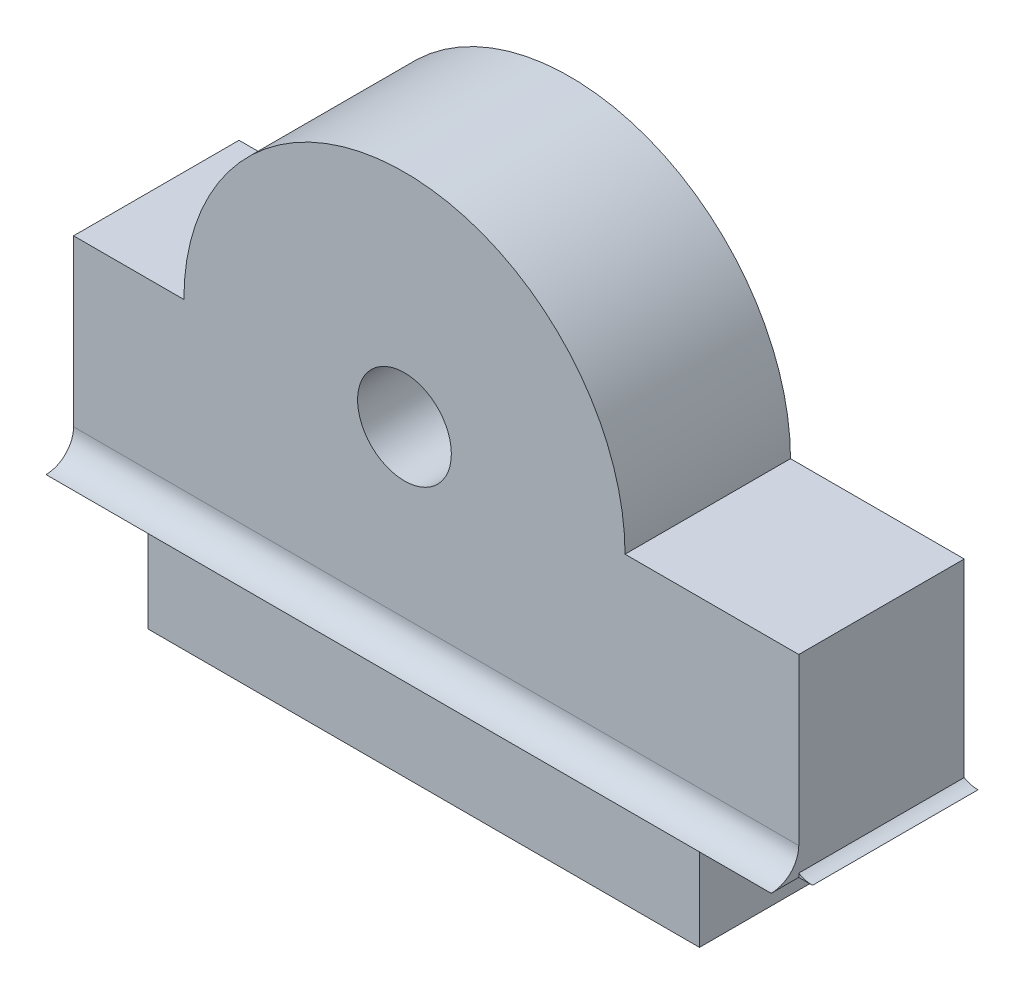
ISO-10303-21;
HEADER;
FILE_DESCRIPTION(('STEP AP214'),'2;1');
FILE_NAME('part.step','',(''),(''),'','','');
FILE_SCHEMA(('AUTOMOTIVE_DESIGN { 1 0 10303 214 1 1 1 1 }'));
ENDSEC;
DATA;
#1=APPLICATION_CONTEXT('core data for automotive mechanical design processes');
#2=APPLICATION_PROTOCOL_DEFINITION('international standard','automotive_design',2000,#1);
#3=PRODUCT_CONTEXT('',#1,'mechanical');
#4=PRODUCT('Part','Part','',(#3));
#5=PRODUCT_RELATED_PRODUCT_CATEGORY('part','',(#4));
#6=PRODUCT_DEFINITION_FORMATION('','',#4);
#7=PRODUCT_DEFINITION_CONTEXT('part definition',#1,'design');
#8=PRODUCT_DEFINITION('design','',#6,#7);
#9=PRODUCT_DEFINITION_SHAPE('','',#8);
#10=(LENGTH_UNIT() NAMED_UNIT(*) SI_UNIT(.MILLI.,.METRE.));
#11=(NAMED_UNIT(*) PLANE_ANGLE_UNIT() SI_UNIT($,.RADIAN.));
#12=(NAMED_UNIT(*) SI_UNIT($,.STERADIAN.) SOLID_ANGLE_UNIT());
#13=UNCERTAINTY_MEASURE_WITH_UNIT(LENGTH_MEASURE(1.E-05),#10,'distance_accuracy_value','');
#14=(GEOMETRIC_REPRESENTATION_CONTEXT(3) GLOBAL_UNCERTAINTY_ASSIGNED_CONTEXT((#13)) GLOBAL_UNIT_ASSIGNED_CONTEXT((#10,
#11,#12)) REPRESENTATION_CONTEXT('',''));
#15=CARTESIAN_POINT('',(0.,0.,0.));
#16=DIRECTION('',(0.,0.,1.));
#17=DIRECTION('',(1.,0.,0.));
#18=AXIS2_PLACEMENT_3D('',#15,#16,#17);
#19=CARTESIAN_POINT('',(12.9373066958946,11.,6.));
#20=DIRECTION('',(-0.866025403784439,-0.5,0.));
#21=DIRECTION('',(0.5,-0.866025403784439,0.));
#22=AXIS2_PLACEMENT_3D('',#19,#20,#21);
#23=PLANE('',#22);
#24=DIRECTION('',(0.,0.,-1.));
#25=VECTOR('',#24,1.);
#26=CARTESIAN_POINT('',(12.9373066958946,11.,6.));
#27=LINE('',#26,#25);
#28=CARTESIAN_POINT('',(12.9373066958946,11.,3.));
#29=VERTEX_POINT('',#28);
#30=CARTESIAN_POINT('',(12.9373066958946,11.,0.));
#31=VERTEX_POINT('',#30);
#32=EDGE_CURVE('E187',#29,#31,#27,.T.);
#33=ORIENTED_EDGE('',*,*,#32,.F.);
#34=DIRECTION('',(-0.5,0.866025403784439,0.));
#35=VECTOR('',#34,1.);
#36=CARTESIAN_POINT('',(12.9373066958946,11.,3.));
#37=LINE('',#36,#35);
#38=CARTESIAN_POINT('',(11.1186533479473,14.15,3.));
#39=VERTEX_POINT('',#38);
#40=EDGE_CURVE('E47',#29,#39,#37,.T.);
#41=ORIENTED_EDGE('',*,*,#40,.T.);
#42=DIRECTION('',(0.,0.,-1.));
#43=VECTOR('',#42,1.);
#44=CARTESIAN_POINT('',(11.1186533479473,14.15,6.));
#45=LINE('',#44,#43);
#46=CARTESIAN_POINT('',(11.1186533479473,14.15,0.));
#47=VERTEX_POINT('',#46);
#48=EDGE_CURVE('E197',#39,#47,#45,.T.);
#49=ORIENTED_EDGE('',*,*,#48,.T.);
#50=DIRECTION('',(-0.5,0.866025403784439,0.));
#51=VECTOR('',#50,1.);
#52=CARTESIAN_POINT('',(12.9373066958946,11.,0.));
#53=LINE('',#52,#51);
#54=EDGE_CURVE('E293',#31,#47,#53,.T.);
#55=ORIENTED_EDGE('',*,*,#54,.F.);
#56=EDGE_LOOP('',(#33,#41,#49,#55));
#57=FACE_BOUND('',#56,.T.);
#58=ADVANCED_FACE('F32',(#57),#23,.T.);
#59=CARTESIAN_POINT('',(11.1186533479473,14.15,6.));
#60=DIRECTION('',(0.,-1.,0.));
#61=DIRECTION('',(1.,0.,0.));
#62=AXIS2_PLACEMENT_3D('',#59,#60,#61);
#63=PLANE('',#62);
#64=ORIENTED_EDGE('',*,*,#48,.F.);
#65=DIRECTION('',(-1.,0.,0.));
#66=VECTOR('',#65,1.);
#67=CARTESIAN_POINT('',(11.1186533479473,14.15,3.));
#68=LINE('',#67,#66);
#69=CARTESIAN_POINT('',(7.48134665205268,14.15,3.));
#70=VERTEX_POINT('',#69);
#71=EDGE_CURVE('E326',#39,#70,#68,.T.);
#72=ORIENTED_EDGE('',*,*,#71,.T.);
#73=DIRECTION('',(0.,0.,-1.));
#74=VECTOR('',#73,1.);
#75=CARTESIAN_POINT('',(7.48134665205268,14.15,6.));
#76=LINE('',#75,#74);
#77=CARTESIAN_POINT('',(7.48134665205268,14.15,0.));
#78=VERTEX_POINT('',#77);
#79=EDGE_CURVE('E195',#70,#78,#76,.T.);
#80=ORIENTED_EDGE('',*,*,#79,.T.);
#81=DIRECTION('',(-1.,0.,0.));
#82=VECTOR('',#81,1.);
#83=CARTESIAN_POINT('',(11.1186533479473,14.15,0.));
#84=LINE('',#83,#82);
#85=EDGE_CURVE('E307',#47,#78,#84,.T.);
#86=ORIENTED_EDGE('',*,*,#85,.F.);
#87=EDGE_LOOP('',(#64,#72,#80,#86));
#88=FACE_BOUND('',#87,.T.);
#89=ADVANCED_FACE('F395',(#88),#63,.T.);
#90=CARTESIAN_POINT('',(7.48134665205268,14.15,6.));
#91=DIRECTION('',(0.866025403784439,-0.5,0.));
#92=DIRECTION('',(0.5,0.866025403784439,0.));
#93=AXIS2_PLACEMENT_3D('',#90,#91,#92);
#94=PLANE('',#93);
#95=ORIENTED_EDGE('',*,*,#79,.F.);
#96=DIRECTION('',(-0.5,-0.866025403784439,0.));
#97=VECTOR('',#96,1.);
#98=CARTESIAN_POINT('',(7.48134665205268,14.15,3.));
#99=LINE('',#98,#97);
#100=CARTESIAN_POINT('',(5.66269330410536,11.,3.));
#101=VERTEX_POINT('',#100);
#102=EDGE_CURVE('E324',#70,#101,#99,.T.);
#103=ORIENTED_EDGE('',*,*,#102,.T.);
#104=DIRECTION('',(0.,0.,-1.));
#105=VECTOR('',#104,1.);
#106=CARTESIAN_POINT('',(5.66269330410536,11.,6.));
#107=LINE('',#106,#105);
#108=CARTESIAN_POINT('',(5.66269330410536,11.,0.));
#109=VERTEX_POINT('',#108);
#110=EDGE_CURVE('E189',#101,#109,#107,.T.);
#111=ORIENTED_EDGE('',*,*,#110,.T.);
#112=DIRECTION('',(-0.5,-0.866025403784439,0.));
#113=VECTOR('',#112,1.);
#114=CARTESIAN_POINT('',(7.48134665205268,14.15,0.));
#115=LINE('',#114,#113);
#116=EDGE_CURVE('E310',#78,#109,#115,.T.);
#117=ORIENTED_EDGE('',*,*,#116,.F.);
#118=EDGE_LOOP('',(#95,#103,#111,#117));
#119=FACE_BOUND('',#118,.T.);
#120=ADVANCED_FACE('F401',(#119),#94,.T.);
#121=CARTESIAN_POINT('',(5.66269330410536,11.,6.));
#122=DIRECTION('',(0.866025403784438,0.5,0.));
#123=DIRECTION('',(-0.5,0.866025403784439,0.));
#124=AXIS2_PLACEMENT_3D('',#121,#122,#123);
#125=PLANE('',#124);
#126=ORIENTED_EDGE('',*,*,#110,.F.);
#127=DIRECTION('',(0.5,-0.866025403784439,0.));
#128=VECTOR('',#127,1.);
#129=CARTESIAN_POINT('',(5.66269330410536,11.,3.));
#130=LINE('',#129,#128);
#131=CARTESIAN_POINT('',(7.48134665205267,7.85000000000002,3.));
#132=VERTEX_POINT('',#131);
#133=EDGE_CURVE('E180',#101,#132,#130,.T.);
#134=ORIENTED_EDGE('',*,*,#133,.T.);
#135=DIRECTION('',(0.,0.,-1.));
#136=VECTOR('',#135,1.);
#137=CARTESIAN_POINT('',(7.48134665205267,7.85000000000002,6.));
#138=LINE('',#137,#136);
#139=CARTESIAN_POINT('',(7.48134665205267,7.85000000000002,0.));
#140=VERTEX_POINT('',#139);
#141=EDGE_CURVE('E179',#132,#140,#138,.T.);
#142=ORIENTED_EDGE('',*,*,#141,.T.);
#143=DIRECTION('',(0.5,-0.866025403784439,0.));
#144=VECTOR('',#143,1.);
#145=CARTESIAN_POINT('',(5.66269330410536,11.,0.));
#146=LINE('',#145,#144);
#147=EDGE_CURVE('E313',#109,#140,#146,.T.);
#148=ORIENTED_EDGE('',*,*,#147,.F.);
#149=EDGE_LOOP('',(#126,#134,#142,#148));
#150=FACE_BOUND('',#149,.T.);
#151=ADVANCED_FACE('F322',(#150),#125,.T.);
#152=CARTESIAN_POINT('',(7.48134665205267,7.85000000000002,6.));
#153=DIRECTION('',(0.,1.,0.));
#154=DIRECTION('',(-1.,0.,0.));
#155=AXIS2_PLACEMENT_3D('',#152,#153,#154);
#156=PLANE('',#155);
#157=ORIENTED_EDGE('',*,*,#141,.F.);
#158=DIRECTION('',(1.,0.,0.));
#159=VECTOR('',#158,1.);
#160=CARTESIAN_POINT('',(7.48134665205267,7.85000000000002,3.));
#161=LINE('',#160,#159);
#162=CARTESIAN_POINT('',(11.1186533479473,7.85000000000001,3.));
#163=VERTEX_POINT('',#162);
#164=EDGE_CURVE('E168',#132,#163,#161,.T.);
#165=ORIENTED_EDGE('',*,*,#164,.T.);
#166=DIRECTION('',(0.,0.,-1.));
#167=VECTOR('',#166,1.);
#168=CARTESIAN_POINT('',(11.1186533479473,7.85000000000001,6.));
#169=LINE('',#168,#167);
#170=CARTESIAN_POINT('',(11.1186533479473,7.85000000000001,0.));
#171=VERTEX_POINT('',#170);
#172=EDGE_CURVE('E177',#163,#171,#169,.T.);
#173=ORIENTED_EDGE('',*,*,#172,.T.);
#174=DIRECTION('',(1.,0.,0.));
#175=VECTOR('',#174,1.);
#176=CARTESIAN_POINT('',(7.48134665205267,7.85000000000002,0.));
#177=LINE('',#176,#175);
#178=EDGE_CURVE('E316',#140,#171,#177,.T.);
#179=ORIENTED_EDGE('',*,*,#178,.F.);
#180=EDGE_LOOP('',(#157,#165,#173,#179));
#181=FACE_BOUND('',#180,.T.);
#182=ADVANCED_FACE('F175',(#181),#156,.T.);
#183=CARTESIAN_POINT('',(11.1186533479473,7.85000000000001,6.));
#184=DIRECTION('',(-0.866025403784439,0.5,0.));
#185=DIRECTION('',(-0.5,-0.866025403784439,0.));
#186=AXIS2_PLACEMENT_3D('',#183,#184,#185);
#187=PLANE('',#186);
#188=ORIENTED_EDGE('',*,*,#172,.F.);
#189=DIRECTION('',(0.5,0.866025403784439,0.));
#190=VECTOR('',#189,1.);
#191=CARTESIAN_POINT('',(11.1186533479473,7.85000000000001,3.));
#192=LINE('',#191,#190);
#193=EDGE_CURVE('E11',#163,#29,#192,.T.);
#194=ORIENTED_EDGE('',*,*,#193,.T.);
#195=ORIENTED_EDGE('',*,*,#32,.T.);
#196=DIRECTION('',(0.5,0.866025403784439,0.));
#197=VECTOR('',#196,1.);
#198=CARTESIAN_POINT('',(11.1186533479473,7.85000000000001,0.));
#199=LINE('',#198,#197);
#200=EDGE_CURVE('E185',#171,#31,#199,.T.);
#201=ORIENTED_EDGE('',*,*,#200,.F.);
#202=EDGE_LOOP('',(#188,#194,#195,#201));
#203=FACE_BOUND('',#202,.T.);
#204=ADVANCED_FACE('F183',(#203),#187,.T.);
#205=CARTESIAN_POINT('',(9.29999999999998,11.,6.));
#206=DIRECTION('',(0.,0.,1.));
#207=DIRECTION('',(1.,0.,0.));
#208=AXIS2_PLACEMENT_3D('',#205,#206,#207);
#209=PLANE('',#208);
#210=DIRECTION('',(0.,-1.,0.));
#211=VECTOR('',#210,1.);
#212=CARTESIAN_POINT('',(-2.7,4.,6.));
#213=LINE('',#212,#211);
#214=CARTESIAN_POINT('',(-2.7,11.,6.));
#215=VERTEX_POINT('',#214);
#216=CARTESIAN_POINT('',(-2.7,5.,6.));
#217=VERTEX_POINT('',#216);
#218=EDGE_CURVE('E216',#215,#217,#213,.T.);
#219=ORIENTED_EDGE('',*,*,#218,.T.);
#220=DIRECTION('',(-1.,0.,0.));
#221=VECTOR('',#220,1.);
#222=CARTESIAN_POINT('',(25.0142135623731,5.,6.));
#223=LINE('',#222,#221);
#224=CARTESIAN_POINT('',(-1.49999999999999,5.,6.));
#225=VERTEX_POINT('',#224);
#226=EDGE_CURVE('E54',#225,#217,#223,.T.);
#227=ORIENTED_EDGE('',*,*,#226,.F.);
#228=CARTESIAN_POINT('',(23.1,5.,6.));
#229=VERTEX_POINT('',#228);
#230=EDGE_CURVE('E296',#229,#225,#223,.T.);
#231=ORIENTED_EDGE('',*,*,#230,.F.);
#232=CARTESIAN_POINT('',(23.6,5.,6.));
#233=VERTEX_POINT('',#232);
#234=EDGE_CURVE('E290',#233,#229,#223,.T.);
#235=ORIENTED_EDGE('',*,*,#234,.F.);
#236=DIRECTION('',(0.,1.,0.));
#237=VECTOR('',#236,1.);
#238=CARTESIAN_POINT('',(23.6,11.,6.));
#239=LINE('',#238,#237);
#240=CARTESIAN_POINT('',(23.6,11.,6.));
#241=VERTEX_POINT('',#240);
#242=EDGE_CURVE('E208',#233,#241,#239,.T.);
#243=ORIENTED_EDGE('',*,*,#242,.T.);
#244=DIRECTION('',(-1.,0.,0.));
#245=VECTOR('',#244,1.);
#246=CARTESIAN_POINT('',(17.3,11.,6.));
#247=LINE('',#246,#245);
#248=CARTESIAN_POINT('',(17.3,11.,6.));
#249=VERTEX_POINT('',#248);
#250=EDGE_CURVE('E210',#241,#249,#247,.T.);
#251=ORIENTED_EDGE('',*,*,#250,.T.);
#252=CARTESIAN_POINT('',(9.29999999999998,11.,6.));
#253=DIRECTION('',(0.,0.,1.));
#254=DIRECTION('',(1.,0.,0.));
#255=AXIS2_PLACEMENT_3D('',#252,#253,#254);
#256=CIRCLE('',#255,8.00000000000001);
#257=CARTESIAN_POINT('',(1.29999999999998,11.,6.));
#258=VERTEX_POINT('',#257);
#259=EDGE_CURVE('E212',#249,#258,#256,.T.);
#260=ORIENTED_EDGE('',*,*,#259,.T.);
#261=DIRECTION('',(-1.,0.,0.));
#262=VECTOR('',#261,1.);
#263=CARTESIAN_POINT('',(-2.7,11.,6.));
#264=LINE('',#263,#262);
#265=EDGE_CURVE('E214',#258,#215,#264,.T.);
#266=ORIENTED_EDGE('',*,*,#265,.T.);
#267=EDGE_LOOP('',(#219,#227,#231,#235,#243,#251,#260,#266));
#268=FACE_BOUND('',#267,.T.);
#269=CARTESIAN_POINT('',(9.29999999999998,11.,6.));
#270=DIRECTION('',(0.,0.,1.));
#271=DIRECTION('',(1.,0.,0.));
#272=AXIS2_PLACEMENT_3D('',#269,#270,#271);
#273=CIRCLE('',#272,1.7);
#274=CARTESIAN_POINT('',(11.,11.,6.));
#275=VERTEX_POINT('',#274);
#276=EDGE_CURVE('E580',#275,#275,#273,.T.);
#277=ORIENTED_EDGE('',*,*,#276,.F.);
#278=EDGE_LOOP('',(#277));
#279=FACE_BOUND('',#278,.T.);
#280=ADVANCED_FACE('F357',(#268,#279),#209,.T.);
#281=DIRECTION('',(-1.,0.,0.));
#282=VECTOR('',#281,1.);
#283=CARTESIAN_POINT('',(25.0142135623731,4.,6.));
#284=LINE('',#283,#282);
#285=CARTESIAN_POINT('',(20.,4.,6.));
#286=VERTEX_POINT('',#285);
#287=CARTESIAN_POINT('',(0.,4.,6.));
#288=VERTEX_POINT('',#287);
#289=EDGE_CURVE('E287',#286,#288,#284,.T.);
#290=ORIENTED_EDGE('',*,*,#289,.T.);
#291=DIRECTION('',(0.,-1.,0.));
#292=VECTOR('',#291,1.);
#293=CARTESIAN_POINT('',(0.,0.,6.));
#294=LINE('',#293,#292);
#295=CARTESIAN_POINT('',(0.,0.,6.));
#296=VERTEX_POINT('',#295);
#297=EDGE_CURVE('E200',#288,#296,#294,.T.);
#298=ORIENTED_EDGE('',*,*,#297,.T.);
#299=DIRECTION('',(1.,0.,0.));
#300=VECTOR('',#299,1.);
#301=CARTESIAN_POINT('',(0.,0.,6.));
#302=LINE('',#301,#300);
#303=CARTESIAN_POINT('',(20.,0.,6.));
#304=VERTEX_POINT('',#303);
#305=EDGE_CURVE('E203',#296,#304,#302,.T.);
#306=ORIENTED_EDGE('',*,*,#305,.T.);
#307=DIRECTION('',(0.,1.,0.));
#308=VECTOR('',#307,1.);
#309=CARTESIAN_POINT('',(20.,0.,6.));
#310=LINE('',#309,#308);
#311=EDGE_CURVE('E206',#304,#286,#310,.T.);
#312=ORIENTED_EDGE('',*,*,#311,.T.);
#313=EDGE_LOOP('',(#290,#298,#306,#312));
#314=FACE_BOUND('',#313,.T.);
#315=ADVANCED_FACE('F406',(#314),#209,.T.);
#316=CARTESIAN_POINT('',(9.29999999999998,11.,0.));
#317=DIRECTION('',(0.,0.,1.));
#318=DIRECTION('',(1.,0.,0.));
#319=AXIS2_PLACEMENT_3D('',#316,#317,#318);
#320=PLANE('',#319);
#321=DIRECTION('',(0.,-1.,0.));
#322=VECTOR('',#321,1.);
#323=CARTESIAN_POINT('',(0.,0.,0.));
#324=LINE('',#323,#322);
#325=CARTESIAN_POINT('',(0.,4.,0.));
#326=VERTEX_POINT('',#325);
#327=CARTESIAN_POINT('',(0.,0.,0.));
#328=VERTEX_POINT('',#327);
#329=EDGE_CURVE('E199',#326,#328,#324,.T.);
#330=ORIENTED_EDGE('',*,*,#329,.F.);
#331=DIRECTION('',(1.,0.,0.));
#332=VECTOR('',#331,1.);
#333=CARTESIAN_POINT('',(0.,4.,0.));
#334=LINE('',#333,#332);
#335=CARTESIAN_POINT('',(-2.7,4.,0.));
#336=VERTEX_POINT('',#335);
#337=EDGE_CURVE('E204',#336,#326,#334,.T.);
#338=ORIENTED_EDGE('',*,*,#337,.F.);
#339=DIRECTION('',(0.,-1.,0.));
#340=VECTOR('',#339,1.);
#341=CARTESIAN_POINT('',(-2.7,4.,0.));
#342=LINE('',#341,#340);
#343=CARTESIAN_POINT('',(-2.7,11.,0.));
#344=VERTEX_POINT('',#343);
#345=EDGE_CURVE('E235',#344,#336,#342,.T.);
#346=ORIENTED_EDGE('',*,*,#345,.F.);
#347=DIRECTION('',(-1.,0.,0.));
#348=VECTOR('',#347,1.);
#349=CARTESIAN_POINT('',(-2.7,11.,0.));
#350=LINE('',#349,#348);
#351=CARTESIAN_POINT('',(1.29999999999998,11.,0.));
#352=VERTEX_POINT('',#351);
#353=EDGE_CURVE('E233',#352,#344,#350,.T.);
#354=ORIENTED_EDGE('',*,*,#353,.F.);
#355=CARTESIAN_POINT('',(9.29999999999998,11.,0.));
#356=DIRECTION('',(0.,0.,1.));
#357=DIRECTION('',(1.,0.,0.));
#358=AXIS2_PLACEMENT_3D('',#355,#356,#357);
#359=CIRCLE('',#358,8.00000000000001);
#360=CARTESIAN_POINT('',(17.3,11.,0.));
#361=VERTEX_POINT('',#360);
#362=EDGE_CURVE('E231',#361,#352,#359,.T.);
#363=ORIENTED_EDGE('',*,*,#362,.F.);
#364=DIRECTION('',(-1.,0.,0.));
#365=VECTOR('',#364,1.);
#366=CARTESIAN_POINT('',(17.3,11.,0.));
#367=LINE('',#366,#365);
#368=CARTESIAN_POINT('',(23.6,11.,0.));
#369=VERTEX_POINT('',#368);
#370=EDGE_CURVE('E229',#369,#361,#367,.T.);
#371=ORIENTED_EDGE('',*,*,#370,.F.);
#372=DIRECTION('',(0.,1.,0.));
#373=VECTOR('',#372,1.);
#374=CARTESIAN_POINT('',(23.6,11.,0.));
#375=LINE('',#374,#373);
#376=CARTESIAN_POINT('',(23.6,4.13397459621556,0.));
#377=VERTEX_POINT('',#376);
#378=EDGE_CURVE('E227',#377,#369,#375,.T.);
#379=ORIENTED_EDGE('',*,*,#378,.F.);
#380=CARTESIAN_POINT('',(24.1,5.,0.));
#381=DIRECTION('',(0.,0.,1.));
#382=DIRECTION('',(1.,0.,0.));
#383=AXIS2_PLACEMENT_3D('',#380,#381,#382);
#384=CIRCLE('',#383,1.);
#385=CARTESIAN_POINT('',(24.1,4.,0.));
#386=VERTEX_POINT('',#385);
#387=EDGE_CURVE('E340',#377,#386,#384,.T.);
#388=ORIENTED_EDGE('',*,*,#387,.T.);
#389=DIRECTION('',(1.,0.,0.));
#390=VECTOR('',#389,1.);
#391=CARTESIAN_POINT('',(23.6,4.,0.));
#392=LINE('',#391,#390);
#393=CARTESIAN_POINT('',(20.,4.,0.));
#394=VERTEX_POINT('',#393);
#395=EDGE_CURVE('E225',#394,#386,#392,.T.);
#396=ORIENTED_EDGE('',*,*,#395,.F.);
#397=DIRECTION('',(0.,1.,0.));
#398=VECTOR('',#397,1.);
#399=CARTESIAN_POINT('',(20.,0.,0.));
#400=LINE('',#399,#398);
#401=CARTESIAN_POINT('',(20.,0.,0.));
#402=VERTEX_POINT('',#401);
#403=EDGE_CURVE('E223',#402,#394,#400,.T.);
#404=ORIENTED_EDGE('',*,*,#403,.F.);
#405=DIRECTION('',(1.,0.,0.));
#406=VECTOR('',#405,1.);
#407=CARTESIAN_POINT('',(0.,0.,0.));
#408=LINE('',#407,#406);
#409=EDGE_CURVE('E221',#328,#402,#408,.T.);
#410=ORIENTED_EDGE('',*,*,#409,.F.);
#411=EDGE_LOOP('',(#330,#338,#346,#354,#363,#371,#379,#388,#396,#404,#410));
#412=FACE_BOUND('',#411,.T.);
#413=ORIENTED_EDGE('',*,*,#54,.T.);
#414=ORIENTED_EDGE('',*,*,#85,.T.);
#415=ORIENTED_EDGE('',*,*,#116,.T.);
#416=ORIENTED_EDGE('',*,*,#147,.T.);
#417=ORIENTED_EDGE('',*,*,#178,.T.);
#418=ORIENTED_EDGE('',*,*,#200,.T.);
#419=EDGE_LOOP('',(#413,#414,#415,#416,#417,#418));
#420=FACE_BOUND('',#419,.T.);
#421=ADVANCED_FACE('F272',(#412,#420),#320,.F.);
#422=CARTESIAN_POINT('',(0.,0.,6.));
#423=DIRECTION('',(1.,0.,0.));
#424=DIRECTION('',(0.,0.,-1.));
#425=AXIS2_PLACEMENT_3D('',#422,#423,#424);
#426=PLANE('',#425);
#427=ORIENTED_EDGE('',*,*,#329,.T.);
#428=DIRECTION('',(0.,0.,-1.));
#429=VECTOR('',#428,1.);
#430=CARTESIAN_POINT('',(0.,0.,6.));
#431=LINE('',#430,#429);
#432=EDGE_CURVE('E40',#296,#328,#431,.T.);
#433=ORIENTED_EDGE('',*,*,#432,.F.);
#434=ORIENTED_EDGE('',*,*,#297,.F.);
#435=DIRECTION('',(0.,0.,-1.));
#436=VECTOR('',#435,1.);
#437=CARTESIAN_POINT('',(0.,4.,6.));
#438=LINE('',#437,#436);
#439=EDGE_CURVE('E218',#288,#326,#438,.T.);
#440=ORIENTED_EDGE('',*,*,#439,.T.);
#441=EDGE_LOOP('',(#427,#433,#434,#440));
#442=FACE_BOUND('',#441,.T.);
#443=ADVANCED_FACE('F34',(#442),#426,.F.);
#444=CARTESIAN_POINT('',(0.,0.,6.));
#445=DIRECTION('',(0.,1.,0.));
#446=DIRECTION('',(0.,0.,1.));
#447=AXIS2_PLACEMENT_3D('',#444,#445,#446);
#448=PLANE('',#447);
#449=ORIENTED_EDGE('',*,*,#409,.T.);
#450=DIRECTION('',(0.,0.,-1.));
#451=VECTOR('',#450,1.);
#452=CARTESIAN_POINT('',(20.,0.,6.));
#453=LINE('',#452,#451);
#454=EDGE_CURVE('E260',#304,#402,#453,.T.);
#455=ORIENTED_EDGE('',*,*,#454,.F.);
#456=ORIENTED_EDGE('',*,*,#305,.F.);
#457=ORIENTED_EDGE('',*,*,#432,.T.);
#458=EDGE_LOOP('',(#449,#455,#456,#457));
#459=FACE_BOUND('',#458,.T.);
#460=ADVANCED_FACE('F265',(#459),#448,.F.);
#461=CARTESIAN_POINT('',(20.,0.,6.));
#462=DIRECTION('',(-1.,0.,0.));
#463=DIRECTION('',(0.,0.,1.));
#464=AXIS2_PLACEMENT_3D('',#461,#462,#463);
#465=PLANE('',#464);
#466=ORIENTED_EDGE('',*,*,#403,.T.);
#467=DIRECTION('',(0.,0.,-1.));
#468=VECTOR('',#467,1.);
#469=CARTESIAN_POINT('',(20.,4.,6.));
#470=LINE('',#469,#468);
#471=EDGE_CURVE('E257',#286,#394,#470,.T.);
#472=ORIENTED_EDGE('',*,*,#471,.F.);
#473=ORIENTED_EDGE('',*,*,#311,.F.);
#474=ORIENTED_EDGE('',*,*,#454,.T.);
#475=EDGE_LOOP('',(#466,#472,#473,#474));
#476=FACE_BOUND('',#475,.T.);
#477=ADVANCED_FACE('F280',(#476),#465,.F.);
#478=CARTESIAN_POINT('',(23.6,11.,6.));
#479=DIRECTION('',(-1.,0.,0.));
#480=DIRECTION('',(0.,-1.,0.));
#481=AXIS2_PLACEMENT_3D('',#478,#479,#480);
#482=PLANE('',#481);
#483=DIRECTION('',(0.,1.,0.));
#484=VECTOR('',#483,1.);
#485=CARTESIAN_POINT('',(23.6,11.,6.));
#486=LINE('',#485,#484);
#487=CARTESIAN_POINT('',(23.6,4.,6.));
#488=VERTEX_POINT('',#487);
#489=CARTESIAN_POINT('',(23.6,4.13397459621556,6.));
#490=VERTEX_POINT('',#489);
#491=EDGE_CURVE('E342',#488,#490,#486,.T.);
#492=ORIENTED_EDGE('',*,*,#491,.T.);
#493=DIRECTION('',(0.,0.,1.));
#494=VECTOR('',#493,1.);
#495=CARTESIAN_POINT('',(23.6,4.13397459621556,-1.4142135623731));
#496=LINE('',#495,#494);
#497=EDGE_CURVE('E343',#490,#377,#496,.F.);
#498=ORIENTED_EDGE('',*,*,#497,.T.);
#499=ORIENTED_EDGE('',*,*,#378,.T.);
#500=DIRECTION('',(0.,0.,-1.));
#501=VECTOR('',#500,1.);
#502=CARTESIAN_POINT('',(23.6,11.,6.));
#503=LINE('',#502,#501);
#504=EDGE_CURVE('E252',#241,#369,#503,.T.);
#505=ORIENTED_EDGE('',*,*,#504,.F.);
#506=ORIENTED_EDGE('',*,*,#242,.F.);
#507=CARTESIAN_POINT('',(23.6,5.,7.));
#508=DIRECTION('',(-1.,0.,0.));
#509=DIRECTION('',(0.,-1.,0.));
#510=AXIS2_PLACEMENT_3D('',#507,#508,#509);
#511=CIRCLE('',#510,1.);
#512=CARTESIAN_POINT('',(23.6,4.,7.));
#513=VERTEX_POINT('',#512);
#514=EDGE_CURVE('E289',#233,#513,#511,.T.);
#515=ORIENTED_EDGE('',*,*,#514,.T.);
#516=DIRECTION('',(0.,0.,-1.));
#517=VECTOR('',#516,1.);
#518=CARTESIAN_POINT('',(23.6,4.,6.));
#519=LINE('',#518,#517);
#520=EDGE_CURVE('E255',#513,#488,#519,.T.);
#521=ORIENTED_EDGE('',*,*,#520,.T.);
#522=EDGE_LOOP('',(#492,#498,#499,#505,#506,#515,#521));
#523=FACE_BOUND('',#522,.T.);
#524=ADVANCED_FACE('F376',(#523),#482,.F.);
#525=CARTESIAN_POINT('',(17.3,11.,6.));
#526=DIRECTION('',(0.,-1.,0.));
#527=DIRECTION('',(0.,0.,-1.));
#528=AXIS2_PLACEMENT_3D('',#525,#526,#527);
#529=PLANE('',#528);
#530=ORIENTED_EDGE('',*,*,#370,.T.);
#531=DIRECTION('',(0.,0.,-1.));
#532=VECTOR('',#531,1.);
#533=CARTESIAN_POINT('',(17.3,11.,6.));
#534=LINE('',#533,#532);
#535=EDGE_CURVE('E249',#249,#361,#534,.T.);
#536=ORIENTED_EDGE('',*,*,#535,.F.);
#537=ORIENTED_EDGE('',*,*,#250,.F.);
#538=ORIENTED_EDGE('',*,*,#504,.T.);
#539=EDGE_LOOP('',(#530,#536,#537,#538));
#540=FACE_BOUND('',#539,.T.);
#541=ADVANCED_FACE('F373',(#540),#529,.F.);
#542=CARTESIAN_POINT('',(9.29999999999998,11.,6.));
#543=DIRECTION('',(0.,0.,-1.));
#544=DIRECTION('',(-1.,0.,0.));
#545=AXIS2_PLACEMENT_3D('',#542,#543,#544);
#546=CYLINDRICAL_SURFACE('',#545,8.00000000000001);
#547=ORIENTED_EDGE('',*,*,#362,.T.);
#548=DIRECTION('',(0.,0.,-1.));
#549=VECTOR('',#548,1.);
#550=CARTESIAN_POINT('',(1.29999999999998,11.,6.));
#551=LINE('',#550,#549);
#552=EDGE_CURVE('E246',#258,#352,#551,.T.);
#553=ORIENTED_EDGE('',*,*,#552,.F.);
#554=ORIENTED_EDGE('',*,*,#259,.F.);
#555=ORIENTED_EDGE('',*,*,#535,.T.);
#556=EDGE_LOOP('',(#547,#553,#554,#555));
#557=FACE_BOUND('',#556,.T.);
#558=ADVANCED_FACE('F369',(#557),#546,.T.);
#559=CARTESIAN_POINT('',(-2.7,11.,6.));
#560=DIRECTION('',(0.,-1.,0.));
#561=DIRECTION('',(0.,0.,-1.));
#562=AXIS2_PLACEMENT_3D('',#559,#560,#561);
#563=PLANE('',#562);
#564=ORIENTED_EDGE('',*,*,#353,.T.);
#565=DIRECTION('',(0.,0.,-1.));
#566=VECTOR('',#565,1.);
#567=CARTESIAN_POINT('',(-2.7,11.,6.));
#568=LINE('',#567,#566);
#569=EDGE_CURVE('E243',#215,#344,#568,.T.);
#570=ORIENTED_EDGE('',*,*,#569,.F.);
#571=ORIENTED_EDGE('',*,*,#265,.F.);
#572=ORIENTED_EDGE('',*,*,#552,.T.);
#573=EDGE_LOOP('',(#564,#570,#571,#572));
#574=FACE_BOUND('',#573,.T.);
#575=ADVANCED_FACE('F364',(#574),#563,.F.);
#576=CARTESIAN_POINT('',(-2.7,4.,6.));
#577=DIRECTION('',(1.,0.,0.));
#578=DIRECTION('',(0.,1.,0.));
#579=AXIS2_PLACEMENT_3D('',#576,#577,#578);
#580=PLANE('',#579);
#581=ORIENTED_EDGE('',*,*,#345,.T.);
#582=DIRECTION('',(0.,0.,-1.));
#583=VECTOR('',#582,1.);
#584=CARTESIAN_POINT('',(-2.7,4.,6.));
#585=LINE('',#584,#583);
#586=CARTESIAN_POINT('',(-2.7,4.,7.));
#587=VERTEX_POINT('',#586);
#588=EDGE_CURVE('E240',#587,#336,#585,.T.);
#589=ORIENTED_EDGE('',*,*,#588,.F.);
#590=CARTESIAN_POINT('',(-2.7,5.,7.));
#591=DIRECTION('',(1.,0.,0.));
#592=DIRECTION('',(0.,0.,1.));
#593=AXIS2_PLACEMENT_3D('',#590,#591,#592);
#594=CIRCLE('',#593,1.);
#595=EDGE_CURVE('E299',#587,#217,#594,.T.);
#596=ORIENTED_EDGE('',*,*,#595,.T.);
#597=ORIENTED_EDGE('',*,*,#218,.F.);
#598=ORIENTED_EDGE('',*,*,#569,.T.);
#599=EDGE_LOOP('',(#581,#589,#596,#597,#598));
#600=FACE_BOUND('',#599,.T.);
#601=ADVANCED_FACE('F352',(#600),#580,.F.);
#602=CARTESIAN_POINT('',(0.,4.,6.));
#603=DIRECTION('',(0.,1.,0.));
#604=DIRECTION('',(0.,0.,1.));
#605=AXIS2_PLACEMENT_3D('',#602,#603,#604);
#606=PLANE('',#605);
#607=ORIENTED_EDGE('',*,*,#337,.T.);
#608=ORIENTED_EDGE('',*,*,#439,.F.);
#609=ORIENTED_EDGE('',*,*,#289,.F.);
#610=ORIENTED_EDGE('',*,*,#471,.T.);
#611=ORIENTED_EDGE('',*,*,#395,.T.);
#612=DIRECTION('',(0.,0.,1.));
#613=VECTOR('',#612,1.);
#614=CARTESIAN_POINT('',(24.1,4.,-1.4142135623731));
#615=LINE('',#614,#613);
#616=CARTESIAN_POINT('',(24.1,4.,6.));
#617=VERTEX_POINT('',#616);
#618=EDGE_CURVE('E338',#386,#617,#615,.T.);
#619=ORIENTED_EDGE('',*,*,#618,.T.);
#620=DIRECTION('',(1.,0.,0.));
#621=VECTOR('',#620,1.);
#622=CARTESIAN_POINT('',(23.1,4.,6.));
#623=LINE('',#622,#621);
#624=EDGE_CURVE('E333',#488,#617,#623,.T.);
#625=ORIENTED_EDGE('',*,*,#624,.F.);
#626=ORIENTED_EDGE('',*,*,#520,.F.);
#627=DIRECTION('',(-1.,0.,0.));
#628=VECTOR('',#627,1.);
#629=CARTESIAN_POINT('',(25.0142135623731,4.,7.));
#630=LINE('',#629,#628);
#631=EDGE_CURVE('E302',#513,#587,#630,.T.);
#632=ORIENTED_EDGE('',*,*,#631,.T.);
#633=ORIENTED_EDGE('',*,*,#588,.T.);
#634=EDGE_LOOP('',(#607,#608,#609,#610,#611,#619,#625,#626,#632,#633));
#635=FACE_BOUND('',#634,.T.);
#636=ADVANCED_FACE('F284',(#635),#606,.F.);
#637=CARTESIAN_POINT('',(25.0142135623731,5.,7.));
#638=DIRECTION('',(-1.,0.,0.));
#639=DIRECTION('',(0.,0.,1.));
#640=AXIS2_PLACEMENT_3D('',#637,#638,#639);
#641=CYLINDRICAL_SURFACE('',#640,1.);
#642=ORIENTED_EDGE('',*,*,#514,.F.);
#643=ORIENTED_EDGE('',*,*,#234,.T.);
#644=ORIENTED_EDGE('',*,*,#230,.T.);
#645=ORIENTED_EDGE('',*,*,#226,.T.);
#646=ORIENTED_EDGE('',*,*,#595,.F.);
#647=ORIENTED_EDGE('',*,*,#631,.F.);
#648=EDGE_LOOP('',(#642,#643,#644,#645,#646,#647));
#649=FACE_BOUND('',#648,.T.);
#650=ADVANCED_FACE('F356',(#649),#641,.F.);
#651=CARTESIAN_POINT('',(24.1,5.,-1.4142135623731));
#652=DIRECTION('',(0.,0.,1.));
#653=DIRECTION('',(1.,0.,0.));
#654=AXIS2_PLACEMENT_3D('',#651,#652,#653);
#655=CYLINDRICAL_SURFACE('',#654,1.);
#656=ORIENTED_EDGE('',*,*,#497,.F.);
#657=CARTESIAN_POINT('',(24.1,5.,6.));
#658=DIRECTION('',(0.,0.,-1.));
#659=DIRECTION('',(1.,0.,0.));
#660=AXIS2_PLACEMENT_3D('',#657,#658,#659);
#661=CIRCLE('',#660,1.);
#662=EDGE_CURVE('E335',#617,#490,#661,.T.);
#663=ORIENTED_EDGE('',*,*,#662,.F.);
#664=ORIENTED_EDGE('',*,*,#618,.F.);
#665=ORIENTED_EDGE('',*,*,#387,.F.);
#666=EDGE_LOOP('',(#656,#663,#664,#665));
#667=FACE_BOUND('',#666,.T.);
#668=ADVANCED_FACE('F380',(#667),#655,.F.);
#669=CARTESIAN_POINT('',(24.1,5.,6.));
#670=DIRECTION('',(0.,0.,1.));
#671=DIRECTION('',(1.,0.,0.));
#672=AXIS2_PLACEMENT_3D('',#669,#670,#671);
#673=PLANE('',#672);
#674=ORIENTED_EDGE('',*,*,#491,.F.);
#675=ORIENTED_EDGE('',*,*,#624,.T.);
#676=ORIENTED_EDGE('',*,*,#662,.T.);
#677=EDGE_LOOP('',(#674,#675,#676));
#678=FACE_BOUND('',#677,.T.);
#679=ADVANCED_FACE('F384',(#678),#673,.T.);
#680=CARTESIAN_POINT('',(0.,0.,3.));
#681=DIRECTION('',(0.,0.,1.));
#682=DIRECTION('',(1.,0.,0.));
#683=AXIS2_PLACEMENT_3D('',#680,#681,#682);
#684=PLANE('',#683);
#685=ORIENTED_EDGE('',*,*,#40,.F.);
#686=ORIENTED_EDGE('',*,*,#193,.F.);
#687=ORIENTED_EDGE('',*,*,#164,.F.);
#688=ORIENTED_EDGE('',*,*,#133,.F.);
#689=ORIENTED_EDGE('',*,*,#102,.F.);
#690=ORIENTED_EDGE('',*,*,#71,.F.);
#691=EDGE_LOOP('',(#685,#686,#687,#688,#689,#690));
#692=FACE_BOUND('',#691,.T.);
#693=CARTESIAN_POINT('',(9.29999999999998,11.,3.));
#694=DIRECTION('',(0.,0.,1.));
#695=DIRECTION('',(1.,0.,0.));
#696=AXIS2_PLACEMENT_3D('',#693,#694,#695);
#697=CIRCLE('',#696,1.7);
#698=CARTESIAN_POINT('',(11.,11.,3.));
#699=VERTEX_POINT('',#698);
#700=EDGE_CURVE('E181',#699,#699,#697,.T.);
#701=ORIENTED_EDGE('',*,*,#700,.T.);
#702=EDGE_LOOP('',(#701));
#703=FACE_BOUND('',#702,.T.);
#704=ADVANCED_FACE('F166',(#692,#703),#684,.F.);
#705=CARTESIAN_POINT('',(9.29999999999998,11.,3.));
#706=DIRECTION('',(0.,0.,1.));
#707=DIRECTION('',(1.,0.,0.));
#708=AXIS2_PLACEMENT_3D('',#705,#706,#707);
#709=CYLINDRICAL_SURFACE('',#708,1.7);
#710=ORIENTED_EDGE('',*,*,#700,.F.);
#711=EDGE_LOOP('',(#710));
#712=FACE_BOUND('',#711,.T.);
#713=ORIENTED_EDGE('',*,*,#276,.T.);
#714=EDGE_LOOP('',(#713));
#715=FACE_BOUND('',#714,.T.);
#716=ADVANCED_FACE('F391',(#712,#715),#709,.F.);
#717=CLOSED_SHELL('',(#58,#89,#120,#151,#182,#204,#280,#315,#421,#443,#460,#477,#524,#541,#558,
#575,#601,#636,#650,#668,#679,#704,#716));
#718=MANIFOLD_SOLID_BREP('B2',#717);
#719=ADVANCED_BREP_SHAPE_REPRESENTATION('',(#18,#718),#14);
#720=SHAPE_DEFINITION_REPRESENTATION(#9,#719);
ENDSEC;
END-ISO-10303-21;
